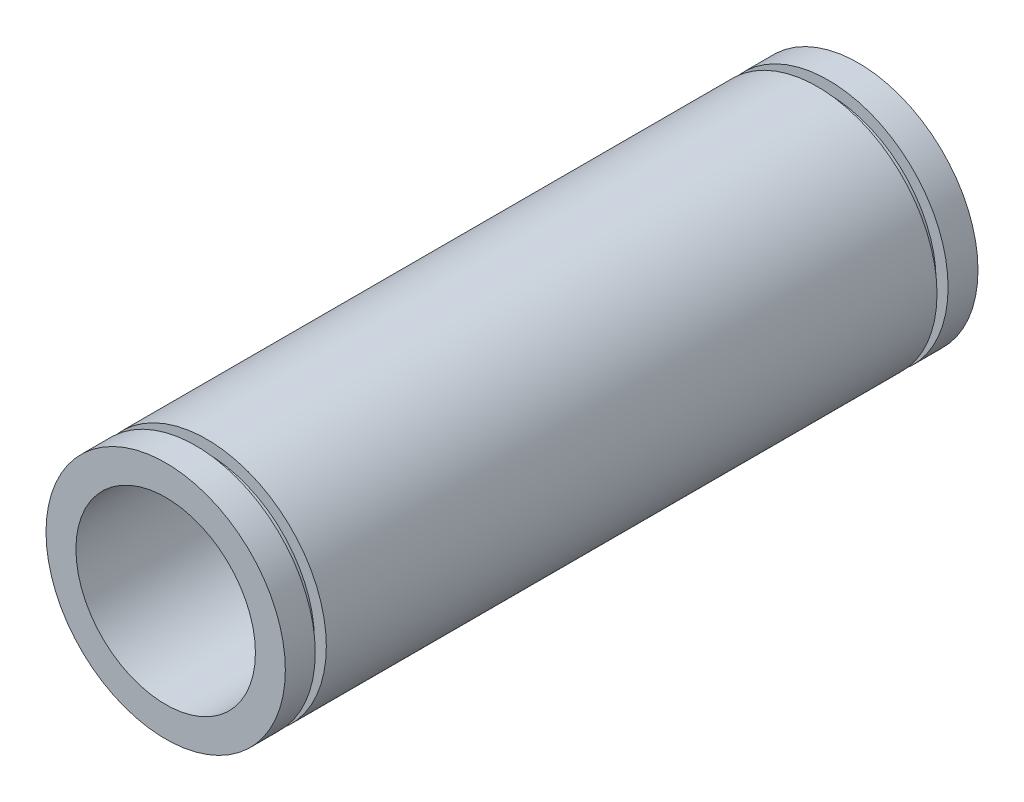
ISO-10303-21;
HEADER;
FILE_DESCRIPTION(('STEP AP214'),'2;1');
FILE_NAME('part.step','',(''),(''),'','','');
FILE_SCHEMA(('AUTOMOTIVE_DESIGN { 1 0 10303 214 1 1 1 1 }'));
ENDSEC;
DATA;
#1=APPLICATION_CONTEXT('core data for automotive mechanical design processes');
#2=APPLICATION_PROTOCOL_DEFINITION('international standard','automotive_design',2000,#1);
#3=PRODUCT_CONTEXT('',#1,'mechanical');
#4=PRODUCT('Part','Part','',(#3));
#5=PRODUCT_RELATED_PRODUCT_CATEGORY('part','',(#4));
#6=PRODUCT_DEFINITION_FORMATION('','',#4);
#7=PRODUCT_DEFINITION_CONTEXT('part definition',#1,'design');
#8=PRODUCT_DEFINITION('design','',#6,#7);
#9=PRODUCT_DEFINITION_SHAPE('','',#8);
#10=(LENGTH_UNIT() NAMED_UNIT(*) SI_UNIT(.MILLI.,.METRE.));
#11=(NAMED_UNIT(*) PLANE_ANGLE_UNIT() SI_UNIT($,.RADIAN.));
#12=(NAMED_UNIT(*) SI_UNIT($,.STERADIAN.) SOLID_ANGLE_UNIT());
#13=UNCERTAINTY_MEASURE_WITH_UNIT(LENGTH_MEASURE(1.E-05),#10,'distance_accuracy_value','');
#14=(GEOMETRIC_REPRESENTATION_CONTEXT(3) GLOBAL_UNCERTAINTY_ASSIGNED_CONTEXT((#13)) GLOBAL_UNIT_ASSIGNED_CONTEXT((#10,
#11,#12)) REPRESENTATION_CONTEXT('',''));
#15=CARTESIAN_POINT('',(0.,0.,0.));
#16=DIRECTION('',(0.,0.,1.));
#17=DIRECTION('',(1.,0.,0.));
#18=AXIS2_PLACEMENT_3D('',#15,#16,#17);
#19=CARTESIAN_POINT('',(0.,0.,52.8796));
#20=DIRECTION('',(0.,0.,-1.));
#21=DIRECTION('',(-1.,0.,0.));
#22=AXIS2_PLACEMENT_3D('',#19,#20,#21);
#23=CYLINDRICAL_SURFACE('',#22,20.);
#24=CARTESIAN_POINT('',(0.,0.,51.0296));
#25=DIRECTION('',(0.,0.,1.));
#26=DIRECTION('',(1.,0.,0.));
#27=AXIS2_PLACEMENT_3D('',#24,#25,#26);
#28=CIRCLE('',#27,20.);
#29=CARTESIAN_POINT('',(20.,0.,51.0296));
#30=VERTEX_POINT('',#29);
#31=EDGE_CURVE('E10',#30,#30,#28,.T.);
#32=ORIENTED_EDGE('',*,*,#31,.F.);
#33=EDGE_LOOP('',(#32));
#34=FACE_BOUND('',#33,.T.);
#35=CARTESIAN_POINT('',(0.,0.,-51.0296));
#36=DIRECTION('',(0.,0.,1.));
#37=DIRECTION('',(1.,0.,0.));
#38=AXIS2_PLACEMENT_3D('',#35,#36,#37);
#39=CIRCLE('',#38,20.);
#40=CARTESIAN_POINT('',(20.,0.,-51.0296));
#41=VERTEX_POINT('',#40);
#42=EDGE_CURVE('E61',#41,#41,#39,.T.);
#43=ORIENTED_EDGE('',*,*,#42,.T.);
#44=EDGE_LOOP('',(#43));
#45=FACE_BOUND('',#44,.T.);
#46=ADVANCED_FACE('F37',(#34,#45),#23,.T.);
#47=CARTESIAN_POINT('',(0.,0.,51.0296));
#48=DIRECTION('',(0.,0.,1.));
#49=DIRECTION('',(1.,0.,0.));
#50=AXIS2_PLACEMENT_3D('',#47,#48,#49);
#51=PLANE('',#50);
#52=CARTESIAN_POINT('',(0.,0.,51.0296));
#53=DIRECTION('',(0.,0.,1.));
#54=DIRECTION('',(1.,0.,0.));
#55=AXIS2_PLACEMENT_3D('',#52,#53,#54);
#56=CIRCLE('',#55,18.);
#57=CARTESIAN_POINT('',(18.,0.,51.0296));
#58=VERTEX_POINT('',#57);
#59=EDGE_CURVE('E45',#58,#58,#56,.T.);
#60=ORIENTED_EDGE('',*,*,#59,.F.);
#61=EDGE_LOOP('',(#60));
#62=FACE_BOUND('',#61,.T.);
#63=ORIENTED_EDGE('',*,*,#31,.T.);
#64=EDGE_LOOP('',(#63));
#65=FACE_BOUND('',#64,.T.);
#66=ADVANCED_FACE('F119',(#62,#65),#51,.T.);
#67=CARTESIAN_POINT('',(0.,0.,51.0296));
#68=DIRECTION('',(0.,0.,1.));
#69=DIRECTION('',(1.,0.,0.));
#70=AXIS2_PLACEMENT_3D('',#67,#68,#69);
#71=CYLINDRICAL_SURFACE('',#70,18.);
#72=ORIENTED_EDGE('',*,*,#59,.T.);
#73=EDGE_LOOP('',(#72));
#74=FACE_BOUND('',#73,.T.);
#75=CARTESIAN_POINT('',(0.,0.,52.8796));
#76=DIRECTION('',(0.,0.,1.));
#77=DIRECTION('',(1.,0.,0.));
#78=AXIS2_PLACEMENT_3D('',#75,#76,#77);
#79=CIRCLE('',#78,18.);
#80=CARTESIAN_POINT('',(18.,0.,52.8796));
#81=VERTEX_POINT('',#80);
#82=EDGE_CURVE('E50',#81,#81,#79,.T.);
#83=ORIENTED_EDGE('',*,*,#82,.F.);
#84=EDGE_LOOP('',(#83));
#85=FACE_BOUND('',#84,.T.);
#86=ADVANCED_FACE('F124',(#74,#85),#71,.T.);
#87=CARTESIAN_POINT('',(0.,0.,57.8796));
#88=DIRECTION('',(0.,0.,-1.));
#89=DIRECTION('',(-1.,0.,0.));
#90=AXIS2_PLACEMENT_3D('',#87,#88,#89);
#91=CYLINDRICAL_SURFACE('',#90,20.);
#92=CARTESIAN_POINT('',(0.,0.,57.8796));
#93=DIRECTION('',(0.,0.,1.));
#94=DIRECTION('',(1.,0.,0.));
#95=AXIS2_PLACEMENT_3D('',#92,#93,#94);
#96=CIRCLE('',#95,20.);
#97=CARTESIAN_POINT('',(20.,0.,57.8796));
#98=VERTEX_POINT('',#97);
#99=EDGE_CURVE('E55',#98,#98,#96,.T.);
#100=ORIENTED_EDGE('',*,*,#99,.F.);
#101=EDGE_LOOP('',(#100));
#102=FACE_BOUND('',#101,.T.);
#103=CARTESIAN_POINT('',(0.,0.,52.8796));
#104=DIRECTION('',(0.,0.,1.));
#105=DIRECTION('',(1.,0.,0.));
#106=AXIS2_PLACEMENT_3D('',#103,#104,#105);
#107=CIRCLE('',#106,20.);
#108=CARTESIAN_POINT('',(20.,0.,52.8796));
#109=VERTEX_POINT('',#108);
#110=EDGE_CURVE('E57',#109,#109,#107,.T.);
#111=ORIENTED_EDGE('',*,*,#110,.T.);
#112=EDGE_LOOP('',(#111));
#113=FACE_BOUND('',#112,.T.);
#114=ADVANCED_FACE('F145',(#102,#113),#91,.T.);
#115=CARTESIAN_POINT('',(0.,0.,57.8796));
#116=DIRECTION('',(0.,0.,1.));
#117=DIRECTION('',(1.,0.,0.));
#118=AXIS2_PLACEMENT_3D('',#115,#116,#117);
#119=PLANE('',#118);
#120=CARTESIAN_POINT('',(0.,0.,57.8796));
#121=DIRECTION('',(0.,0.,-1.));
#122=DIRECTION('',(-1.,0.,0.));
#123=AXIS2_PLACEMENT_3D('',#120,#121,#122);
#124=CIRCLE('',#123,15.);
#125=CARTESIAN_POINT('',(-15.,0.,57.8796));
#126=VERTEX_POINT('',#125);
#127=EDGE_CURVE('E84',#126,#126,#124,.T.);
#128=ORIENTED_EDGE('',*,*,#127,.T.);
#129=EDGE_LOOP('',(#128));
#130=FACE_BOUND('',#129,.T.);
#131=ORIENTED_EDGE('',*,*,#99,.T.);
#132=EDGE_LOOP('',(#131));
#133=FACE_BOUND('',#132,.T.);
#134=ADVANCED_FACE('F140',(#130,#133),#119,.T.);
#135=CARTESIAN_POINT('',(0.,0.,52.8796));
#136=DIRECTION('',(0.,0.,1.));
#137=DIRECTION('',(1.,0.,0.));
#138=AXIS2_PLACEMENT_3D('',#135,#136,#137);
#139=PLANE('',#138);
#140=ORIENTED_EDGE('',*,*,#82,.T.);
#141=EDGE_LOOP('',(#140));
#142=FACE_BOUND('',#141,.T.);
#143=ORIENTED_EDGE('',*,*,#110,.F.);
#144=EDGE_LOOP('',(#143));
#145=FACE_BOUND('',#144,.T.);
#146=ADVANCED_FACE('F131',(#142,#145),#139,.F.);
#147=CARTESIAN_POINT('',(0.,0.,-51.0296));
#148=DIRECTION('',(0.,0.,-1.));
#149=DIRECTION('',(1.,0.,0.));
#150=AXIS2_PLACEMENT_3D('',#147,#148,#149);
#151=PLANE('',#150);
#152=CARTESIAN_POINT('',(0.,0.,-51.0296));
#153=DIRECTION('',(0.,0.,1.));
#154=DIRECTION('',(1.,0.,0.));
#155=AXIS2_PLACEMENT_3D('',#152,#153,#154);
#156=CIRCLE('',#155,18.);
#157=CARTESIAN_POINT('',(18.,0.,-51.0296));
#158=VERTEX_POINT('',#157);
#159=EDGE_CURVE('E68',#158,#158,#156,.T.);
#160=ORIENTED_EDGE('',*,*,#159,.T.);
#161=EDGE_LOOP('',(#160));
#162=FACE_BOUND('',#161,.T.);
#163=ORIENTED_EDGE('',*,*,#42,.F.);
#164=EDGE_LOOP('',(#163));
#165=FACE_BOUND('',#164,.T.);
#166=ADVANCED_FACE('F129',(#162,#165),#151,.T.);
#167=CARTESIAN_POINT('',(0.,0.,-51.0296));
#168=DIRECTION('',(0.,0.,-1.));
#169=DIRECTION('',(1.,0.,0.));
#170=AXIS2_PLACEMENT_3D('',#167,#168,#169);
#171=CYLINDRICAL_SURFACE('',#170,18.);
#172=ORIENTED_EDGE('',*,*,#159,.F.);
#173=EDGE_LOOP('',(#172));
#174=FACE_BOUND('',#173,.T.);
#175=CARTESIAN_POINT('',(0.,0.,-52.8796));
#176=DIRECTION('',(0.,0.,1.));
#177=DIRECTION('',(1.,0.,0.));
#178=AXIS2_PLACEMENT_3D('',#175,#176,#177);
#179=CIRCLE('',#178,18.);
#180=CARTESIAN_POINT('',(18.,0.,-52.8796));
#181=VERTEX_POINT('',#180);
#182=EDGE_CURVE('E69',#181,#181,#179,.T.);
#183=ORIENTED_EDGE('',*,*,#182,.T.);
#184=EDGE_LOOP('',(#183));
#185=FACE_BOUND('',#184,.T.);
#186=ADVANCED_FACE('F106',(#174,#185),#171,.T.);
#187=CARTESIAN_POINT('',(0.,0.,-57.8796));
#188=DIRECTION('',(0.,0.,1.));
#189=DIRECTION('',(-1.,0.,0.));
#190=AXIS2_PLACEMENT_3D('',#187,#188,#189);
#191=CYLINDRICAL_SURFACE('',#190,20.);
#192=CARTESIAN_POINT('',(0.,0.,-57.8796));
#193=DIRECTION('',(0.,0.,1.));
#194=DIRECTION('',(1.,0.,0.));
#195=AXIS2_PLACEMENT_3D('',#192,#193,#194);
#196=CIRCLE('',#195,20.);
#197=CARTESIAN_POINT('',(20.,0.,-57.8796));
#198=VERTEX_POINT('',#197);
#199=EDGE_CURVE('E73',#198,#198,#196,.T.);
#200=ORIENTED_EDGE('',*,*,#199,.T.);
#201=EDGE_LOOP('',(#200));
#202=FACE_BOUND('',#201,.T.);
#203=CARTESIAN_POINT('',(0.,0.,-52.8796));
#204=DIRECTION('',(0.,0.,1.));
#205=DIRECTION('',(1.,0.,0.));
#206=AXIS2_PLACEMENT_3D('',#203,#204,#205);
#207=CIRCLE('',#206,20.);
#208=CARTESIAN_POINT('',(20.,0.,-52.8796));
#209=VERTEX_POINT('',#208);
#210=EDGE_CURVE('E77',#209,#209,#207,.T.);
#211=ORIENTED_EDGE('',*,*,#210,.F.);
#212=EDGE_LOOP('',(#211));
#213=FACE_BOUND('',#212,.T.);
#214=ADVANCED_FACE('F100',(#202,#213),#191,.T.);
#215=CARTESIAN_POINT('',(0.,0.,-57.8796));
#216=DIRECTION('',(0.,0.,-1.));
#217=DIRECTION('',(1.,0.,0.));
#218=AXIS2_PLACEMENT_3D('',#215,#216,#217);
#219=PLANE('',#218);
#220=CARTESIAN_POINT('',(0.,0.,-57.8796));
#221=DIRECTION('',(0.,0.,-1.));
#222=DIRECTION('',(-1.,0.,0.));
#223=AXIS2_PLACEMENT_3D('',#220,#221,#222);
#224=CIRCLE('',#223,15.);
#225=CARTESIAN_POINT('',(-15.,0.,-57.8796));
#226=VERTEX_POINT('',#225);
#227=EDGE_CURVE('E40',#226,#226,#224,.T.);
#228=ORIENTED_EDGE('',*,*,#227,.F.);
#229=EDGE_LOOP('',(#228));
#230=FACE_BOUND('',#229,.T.);
#231=ORIENTED_EDGE('',*,*,#199,.F.);
#232=EDGE_LOOP('',(#231));
#233=FACE_BOUND('',#232,.T.);
#234=ADVANCED_FACE('F96',(#230,#233),#219,.T.);
#235=CARTESIAN_POINT('',(0.,0.,-52.8796));
#236=DIRECTION('',(0.,0.,-1.));
#237=DIRECTION('',(1.,0.,0.));
#238=AXIS2_PLACEMENT_3D('',#235,#236,#237);
#239=PLANE('',#238);
#240=ORIENTED_EDGE('',*,*,#182,.F.);
#241=EDGE_LOOP('',(#240));
#242=FACE_BOUND('',#241,.T.);
#243=ORIENTED_EDGE('',*,*,#210,.T.);
#244=EDGE_LOOP('',(#243));
#245=FACE_BOUND('',#244,.T.);
#246=ADVANCED_FACE('F99',(#242,#245),#239,.F.);
#247=CARTESIAN_POINT('',(0.,0.,57.8796));
#248=DIRECTION('',(0.,0.,-1.));
#249=DIRECTION('',(-1.,0.,0.));
#250=AXIS2_PLACEMENT_3D('',#247,#248,#249);
#251=CYLINDRICAL_SURFACE('',#250,15.);
#252=ORIENTED_EDGE('',*,*,#227,.T.);
#253=EDGE_LOOP('',(#252));
#254=FACE_BOUND('',#253,.T.);
#255=ORIENTED_EDGE('',*,*,#127,.F.);
#256=EDGE_LOOP('',(#255));
#257=FACE_BOUND('',#256,.T.);
#258=ADVANCED_FACE('F93',(#254,#257),#251,.F.);
#259=CLOSED_SHELL('',(#46,#66,#86,#114,#134,#146,#166,#186,#214,#234,#246,#258));
#260=MANIFOLD_SOLID_BREP('B2',#259);
#261=ADVANCED_BREP_SHAPE_REPRESENTATION('',(#18,#260),#14);
#262=SHAPE_DEFINITION_REPRESENTATION(#9,#261);
ENDSEC;
END-ISO-10303-21;
